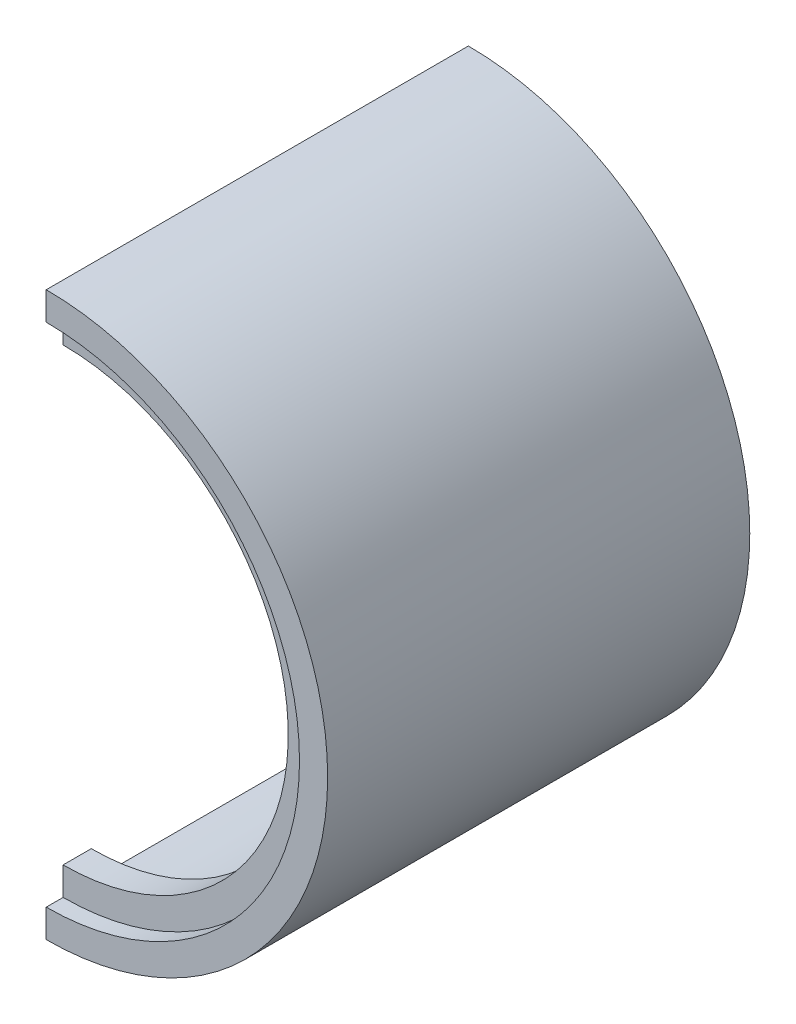
ISO-10303-21;
HEADER;
FILE_DESCRIPTION(('STEP AP214'),'2;1');
FILE_NAME('part.step','',(''),(''),'','','');
FILE_SCHEMA(('AUTOMOTIVE_DESIGN { 1 0 10303 214 1 1 1 1 }'));
ENDSEC;
DATA;
#1=APPLICATION_CONTEXT('core data for automotive mechanical design processes');
#2=APPLICATION_PROTOCOL_DEFINITION('international standard','automotive_design',2000,#1);
#3=PRODUCT_CONTEXT('',#1,'mechanical');
#4=PRODUCT('Part','Part','',(#3));
#5=PRODUCT_RELATED_PRODUCT_CATEGORY('part','',(#4));
#6=PRODUCT_DEFINITION_FORMATION('','',#4);
#7=PRODUCT_DEFINITION_CONTEXT('part definition',#1,'design');
#8=PRODUCT_DEFINITION('design','',#6,#7);
#9=PRODUCT_DEFINITION_SHAPE('','',#8);
#10=(LENGTH_UNIT() NAMED_UNIT(*) SI_UNIT(.MILLI.,.METRE.));
#11=(NAMED_UNIT(*) PLANE_ANGLE_UNIT() SI_UNIT($,.RADIAN.));
#12=(NAMED_UNIT(*) SI_UNIT($,.STERADIAN.) SOLID_ANGLE_UNIT());
#13=UNCERTAINTY_MEASURE_WITH_UNIT(LENGTH_MEASURE(1.E-05),#10,'distance_accuracy_value','');
#14=(GEOMETRIC_REPRESENTATION_CONTEXT(3) GLOBAL_UNCERTAINTY_ASSIGNED_CONTEXT((#13)) GLOBAL_UNIT_ASSIGNED_CONTEXT((#10,
#11,#12)) REPRESENTATION_CONTEXT('',''));
#15=CARTESIAN_POINT('',(0.,0.,0.));
#16=DIRECTION('',(0.,0.,1.));
#17=DIRECTION('',(1.,0.,0.));
#18=AXIS2_PLACEMENT_3D('',#15,#16,#17);
#19=CARTESIAN_POINT('',(-502.733741957931,0.,80.));
#20=DIRECTION('',(0.,0.,1.));
#21=DIRECTION('',(1.,0.,0.));
#22=AXIS2_PLACEMENT_3D('',#19,#20,#21);
#23=PLANE('',#22);
#24=DIRECTION('',(0.,1.,0.));
#25=VECTOR('',#24,1.);
#26=CARTESIAN_POINT('',(597.266258042068,0.,80.));
#27=LINE('',#26,#25);
#28=CARTESIAN_POINT('',(597.266258042068,-50.,80.));
#29=VERTEX_POINT('',#28);
#30=CARTESIAN_POINT('',(597.266258042068,-45.,80.));
#31=VERTEX_POINT('',#30);
#32=EDGE_CURVE('E140',#29,#31,#27,.T.);
#33=ORIENTED_EDGE('',*,*,#32,.F.);
#34=CARTESIAN_POINT('',(597.266258042068,0.,80.));
#35=DIRECTION('',(0.,0.,1.));
#36=DIRECTION('',(1.,0.,0.));
#37=AXIS2_PLACEMENT_3D('',#34,#35,#36);
#38=CIRCLE('',#37,50.);
#39=CARTESIAN_POINT('',(597.266258042068,50.,80.));
#40=VERTEX_POINT('',#39);
#41=EDGE_CURVE('E142',#29,#40,#38,.T.);
#42=ORIENTED_EDGE('',*,*,#41,.T.);
#43=CARTESIAN_POINT('',(597.266258042068,45.,80.));
#44=VERTEX_POINT('',#43);
#45=EDGE_CURVE('E62',#44,#40,#27,.T.);
#46=ORIENTED_EDGE('',*,*,#45,.F.);
#47=CARTESIAN_POINT('',(597.266258042068,0.,80.));
#48=DIRECTION('',(0.,0.,1.));
#49=DIRECTION('',(1.,0.,0.));
#50=AXIS2_PLACEMENT_3D('',#47,#48,#49);
#51=CIRCLE('',#50,45.);
#52=EDGE_CURVE('E145',#31,#44,#51,.T.);
#53=ORIENTED_EDGE('',*,*,#52,.F.);
#54=EDGE_LOOP('',(#33,#42,#46,#53));
#55=FACE_BOUND('',#54,.T.);
#56=ADVANCED_FACE('F38',(#55),#23,.T.);
#57=CARTESIAN_POINT('',(597.266258042068,0.,80.));
#58=DIRECTION('',(0.,0.,-1.));
#59=DIRECTION('',(-1.,0.,0.));
#60=AXIS2_PLACEMENT_3D('',#57,#58,#59);
#61=CYLINDRICAL_SURFACE('',#60,50.);
#62=DIRECTION('',(0.,0.,-1.));
#63=VECTOR('',#62,1.);
#64=CARTESIAN_POINT('',(597.266258042068,-50.,80.));
#65=LINE('',#64,#63);
#66=CARTESIAN_POINT('',(597.266258042068,-50.,5.));
#67=VERTEX_POINT('',#66);
#68=EDGE_CURVE('E47',#29,#67,#65,.T.);
#69=ORIENTED_EDGE('',*,*,#68,.T.);
#70=CARTESIAN_POINT('',(597.266258042068,0.,5.));
#71=DIRECTION('',(0.,0.,1.));
#72=DIRECTION('',(1.,0.,0.));
#73=AXIS2_PLACEMENT_3D('',#70,#71,#72);
#74=CIRCLE('',#73,50.);
#75=CARTESIAN_POINT('',(597.266258042068,50.,5.));
#76=VERTEX_POINT('',#75);
#77=EDGE_CURVE('E155',#67,#76,#74,.T.);
#78=ORIENTED_EDGE('',*,*,#77,.T.);
#79=DIRECTION('',(0.,0.,-1.));
#80=VECTOR('',#79,1.);
#81=CARTESIAN_POINT('',(597.266258042068,50.,80.));
#82=LINE('',#81,#80);
#83=EDGE_CURVE('E12',#40,#76,#82,.T.);
#84=ORIENTED_EDGE('',*,*,#83,.F.);
#85=ORIENTED_EDGE('',*,*,#41,.F.);
#86=EDGE_LOOP('',(#69,#78,#84,#85));
#87=FACE_BOUND('',#86,.T.);
#88=ADVANCED_FACE('F153',(#87),#61,.T.);
#89=CARTESIAN_POINT('',(597.266258042068,0.,80.));
#90=DIRECTION('',(0.,0.,-1.));
#91=DIRECTION('',(-1.,0.,0.));
#92=AXIS2_PLACEMENT_3D('',#89,#90,#91);
#93=CYLINDRICAL_SURFACE('',#92,45.);
#94=CARTESIAN_POINT('',(597.266258042068,0.,77.));
#95=DIRECTION('',(0.,0.,1.));
#96=DIRECTION('',(1.,0.,0.));
#97=AXIS2_PLACEMENT_3D('',#94,#95,#96);
#98=CIRCLE('',#97,45.);
#99=CARTESIAN_POINT('',(597.266258042068,-45.,77.));
#100=VERTEX_POINT('',#99);
#101=CARTESIAN_POINT('',(597.266258042068,45.,77.));
#102=VERTEX_POINT('',#101);
#103=EDGE_CURVE('E42',#100,#102,#98,.T.);
#104=ORIENTED_EDGE('',*,*,#103,.F.);
#105=DIRECTION('',(0.,0.,-1.));
#106=VECTOR('',#105,1.);
#107=CARTESIAN_POINT('',(597.266258042068,-45.,80.));
#108=LINE('',#107,#106);
#109=EDGE_CURVE('E141',#31,#100,#108,.T.);
#110=ORIENTED_EDGE('',*,*,#109,.F.);
#111=ORIENTED_EDGE('',*,*,#52,.T.);
#112=DIRECTION('',(0.,0.,-1.));
#113=VECTOR('',#112,1.);
#114=CARTESIAN_POINT('',(597.266258042068,45.,80.));
#115=LINE('',#114,#113);
#116=EDGE_CURVE('E144',#44,#102,#115,.T.);
#117=ORIENTED_EDGE('',*,*,#116,.T.);
#118=EDGE_LOOP('',(#104,#110,#111,#117));
#119=FACE_BOUND('',#118,.T.);
#120=ADVANCED_FACE('F178',(#119),#93,.F.);
#121=CARTESIAN_POINT('',(597.266258042068,0.,0.));
#122=DIRECTION('',(1.,0.,0.));
#123=DIRECTION('',(0.,0.,-1.));
#124=AXIS2_PLACEMENT_3D('',#121,#122,#123);
#125=PLANE('',#124);
#126=ORIENTED_EDGE('',*,*,#109,.T.);
#127=DIRECTION('',(0.,-1.,0.));
#128=VECTOR('',#127,1.);
#129=CARTESIAN_POINT('',(597.266258042068,0.,77.));
#130=LINE('',#129,#128);
#131=CARTESIAN_POINT('',(597.266258042068,-40.,77.));
#132=VERTEX_POINT('',#131);
#133=EDGE_CURVE('E115',#132,#100,#130,.T.);
#134=ORIENTED_EDGE('',*,*,#133,.F.);
#135=DIRECTION('',(0.,0.,1.));
#136=VECTOR('',#135,1.);
#137=CARTESIAN_POINT('',(597.266258042068,-40.,4.99000000000001));
#138=LINE('',#137,#136);
#139=CARTESIAN_POINT('',(597.266258042068,-40.,72.));
#140=VERTEX_POINT('',#139);
#141=EDGE_CURVE('E124',#140,#132,#138,.T.);
#142=ORIENTED_EDGE('',*,*,#141,.F.);
#143=DIRECTION('',(0.,-1.,0.));
#144=VECTOR('',#143,1.);
#145=CARTESIAN_POINT('',(597.266258042068,0.,72.));
#146=LINE('',#145,#144);
#147=CARTESIAN_POINT('',(597.266258042068,-45.,72.));
#148=VERTEX_POINT('',#147);
#149=EDGE_CURVE('E116',#140,#148,#146,.T.);
#150=ORIENTED_EDGE('',*,*,#149,.T.);
#151=DIRECTION('',(0.,0.,-1.));
#152=VECTOR('',#151,1.);
#153=CARTESIAN_POINT('',(597.266258042068,-45.,80.));
#154=LINE('',#153,#152);
#155=CARTESIAN_POINT('',(597.266258042068,-45.,5.));
#156=VERTEX_POINT('',#155);
#157=EDGE_CURVE('E159',#148,#156,#154,.T.);
#158=ORIENTED_EDGE('',*,*,#157,.T.);
#159=DIRECTION('',(0.,-1.,0.));
#160=VECTOR('',#159,1.);
#161=CARTESIAN_POINT('',(597.266258042068,0.,5.));
#162=LINE('',#161,#160);
#163=EDGE_CURVE('E157',#156,#67,#162,.T.);
#164=ORIENTED_EDGE('',*,*,#163,.T.);
#165=ORIENTED_EDGE('',*,*,#68,.F.);
#166=ORIENTED_EDGE('',*,*,#32,.T.);
#167=EDGE_LOOP('',(#126,#134,#142,#150,#158,#164,#165,#166));
#168=FACE_BOUND('',#167,.T.);
#169=ADVANCED_FACE('F40',(#168),#125,.F.);
#170=ORIENTED_EDGE('',*,*,#83,.T.);
#171=CARTESIAN_POINT('',(597.266258042068,45.,5.));
#172=VERTEX_POINT('',#171);
#173=EDGE_CURVE('E163',#76,#172,#162,.T.);
#174=ORIENTED_EDGE('',*,*,#173,.T.);
#175=DIRECTION('',(0.,0.,-1.));
#176=VECTOR('',#175,1.);
#177=CARTESIAN_POINT('',(597.266258042068,45.,80.));
#178=LINE('',#177,#176);
#179=CARTESIAN_POINT('',(597.266258042068,45.,72.));
#180=VERTEX_POINT('',#179);
#181=EDGE_CURVE('E137',#180,#172,#178,.T.);
#182=ORIENTED_EDGE('',*,*,#181,.F.);
#183=CARTESIAN_POINT('',(597.266258042068,40.,72.));
#184=VERTEX_POINT('',#183);
#185=EDGE_CURVE('E131',#180,#184,#146,.T.);
#186=ORIENTED_EDGE('',*,*,#185,.T.);
#187=DIRECTION('',(0.,0.,1.));
#188=VECTOR('',#187,1.);
#189=CARTESIAN_POINT('',(597.266258042068,40.,4.99000000000001));
#190=LINE('',#189,#188);
#191=CARTESIAN_POINT('',(597.266258042068,40.,77.));
#192=VERTEX_POINT('',#191);
#193=EDGE_CURVE('E122',#192,#184,#190,.F.);
#194=ORIENTED_EDGE('',*,*,#193,.F.);
#195=EDGE_CURVE('E107',#102,#192,#130,.T.);
#196=ORIENTED_EDGE('',*,*,#195,.F.);
#197=ORIENTED_EDGE('',*,*,#116,.F.);
#198=ORIENTED_EDGE('',*,*,#45,.T.);
#199=EDGE_LOOP('',(#170,#174,#182,#186,#194,#196,#197,#198));
#200=FACE_BOUND('',#199,.T.);
#201=ADVANCED_FACE('F128',(#200),#125,.F.);
#202=CARTESIAN_POINT('',(597.266258042068,-45.,77.));
#203=DIRECTION('',(0.,0.,1.));
#204=DIRECTION('',(1.,0.,0.));
#205=AXIS2_PLACEMENT_3D('',#202,#203,#204);
#206=PLANE('',#205);
#207=ORIENTED_EDGE('',*,*,#133,.T.);
#208=ORIENTED_EDGE('',*,*,#103,.T.);
#209=ORIENTED_EDGE('',*,*,#195,.T.);
#210=CARTESIAN_POINT('',(597.266258042068,0.,77.));
#211=DIRECTION('',(0.,0.,1.));
#212=DIRECTION('',(1.,0.,0.));
#213=AXIS2_PLACEMENT_3D('',#210,#211,#212);
#214=CIRCLE('',#213,40.);
#215=EDGE_CURVE('E111',#192,#132,#214,.F.);
#216=ORIENTED_EDGE('',*,*,#215,.T.);
#217=EDGE_LOOP('',(#207,#208,#209,#216));
#218=FACE_BOUND('',#217,.T.);
#219=ADVANCED_FACE('F110',(#218),#206,.T.);
#220=CARTESIAN_POINT('',(597.266258042068,0.,4.99000000000001));
#221=DIRECTION('',(0.,0.,1.));
#222=DIRECTION('',(1.,0.,0.));
#223=AXIS2_PLACEMENT_3D('',#220,#221,#222);
#224=CYLINDRICAL_SURFACE('',#223,40.);
#225=ORIENTED_EDGE('',*,*,#193,.T.);
#226=CARTESIAN_POINT('',(597.266258042068,0.,72.));
#227=DIRECTION('',(0.,0.,1.));
#228=DIRECTION('',(1.,0.,0.));
#229=AXIS2_PLACEMENT_3D('',#226,#227,#228);
#230=CIRCLE('',#229,40.);
#231=EDGE_CURVE('E126',#184,#140,#230,.F.);
#232=ORIENTED_EDGE('',*,*,#231,.T.);
#233=ORIENTED_EDGE('',*,*,#141,.T.);
#234=ORIENTED_EDGE('',*,*,#215,.F.);
#235=EDGE_LOOP('',(#225,#232,#233,#234));
#236=FACE_BOUND('',#235,.T.);
#237=ADVANCED_FACE('F120',(#236),#224,.F.);
#238=CARTESIAN_POINT('',(597.266258042068,-45.,5.));
#239=DIRECTION('',(0.,0.,1.));
#240=DIRECTION('',(1.,0.,0.));
#241=AXIS2_PLACEMENT_3D('',#238,#239,#240);
#242=PLANE('',#241);
#243=ORIENTED_EDGE('',*,*,#77,.F.);
#244=ORIENTED_EDGE('',*,*,#163,.F.);
#245=CARTESIAN_POINT('',(597.266258042068,0.,5.));
#246=DIRECTION('',(0.,0.,1.));
#247=DIRECTION('',(1.,0.,0.));
#248=AXIS2_PLACEMENT_3D('',#245,#246,#247);
#249=CIRCLE('',#248,45.);
#250=EDGE_CURVE('E171',#156,#172,#249,.T.);
#251=ORIENTED_EDGE('',*,*,#250,.T.);
#252=ORIENTED_EDGE('',*,*,#173,.F.);
#253=EDGE_LOOP('',(#243,#244,#251,#252));
#254=FACE_BOUND('',#253,.T.);
#255=ADVANCED_FACE('F166',(#254),#242,.F.);
#256=CARTESIAN_POINT('',(597.266258042068,0.,80.));
#257=DIRECTION('',(0.,0.,-1.));
#258=DIRECTION('',(-1.,0.,0.));
#259=AXIS2_PLACEMENT_3D('',#256,#257,#258);
#260=CYLINDRICAL_SURFACE('',#259,45.);
#261=ORIENTED_EDGE('',*,*,#157,.F.);
#262=CARTESIAN_POINT('',(597.266258042068,0.,72.));
#263=DIRECTION('',(0.,0.,1.));
#264=DIRECTION('',(1.,0.,0.));
#265=AXIS2_PLACEMENT_3D('',#262,#263,#264);
#266=CIRCLE('',#265,45.);
#267=EDGE_CURVE('E125',#148,#180,#266,.T.);
#268=ORIENTED_EDGE('',*,*,#267,.T.);
#269=ORIENTED_EDGE('',*,*,#181,.T.);
#270=ORIENTED_EDGE('',*,*,#250,.F.);
#271=EDGE_LOOP('',(#261,#268,#269,#270));
#272=FACE_BOUND('',#271,.T.);
#273=ADVANCED_FACE('F175',(#272),#260,.F.);
#274=CARTESIAN_POINT('',(0.,0.,72.));
#275=DIRECTION('',(0.,0.,1.));
#276=DIRECTION('',(1.,0.,0.));
#277=AXIS2_PLACEMENT_3D('',#274,#275,#276);
#278=PLANE('',#277);
#279=ORIENTED_EDGE('',*,*,#231,.F.);
#280=ORIENTED_EDGE('',*,*,#185,.F.);
#281=ORIENTED_EDGE('',*,*,#267,.F.);
#282=ORIENTED_EDGE('',*,*,#149,.F.);
#283=EDGE_LOOP('',(#279,#280,#281,#282));
#284=FACE_BOUND('',#283,.T.);
#285=ADVANCED_FACE('F195',(#284),#278,.F.);
#286=CLOSED_SHELL('',(#56,#88,#120,#169,#201,#219,#237,#255,#273,#285));
#287=MANIFOLD_SOLID_BREP('B2',#286);
#288=ADVANCED_BREP_SHAPE_REPRESENTATION('',(#18,#287),#14);
#289=SHAPE_DEFINITION_REPRESENTATION(#9,#288);
ENDSEC;
END-ISO-10303-21;
